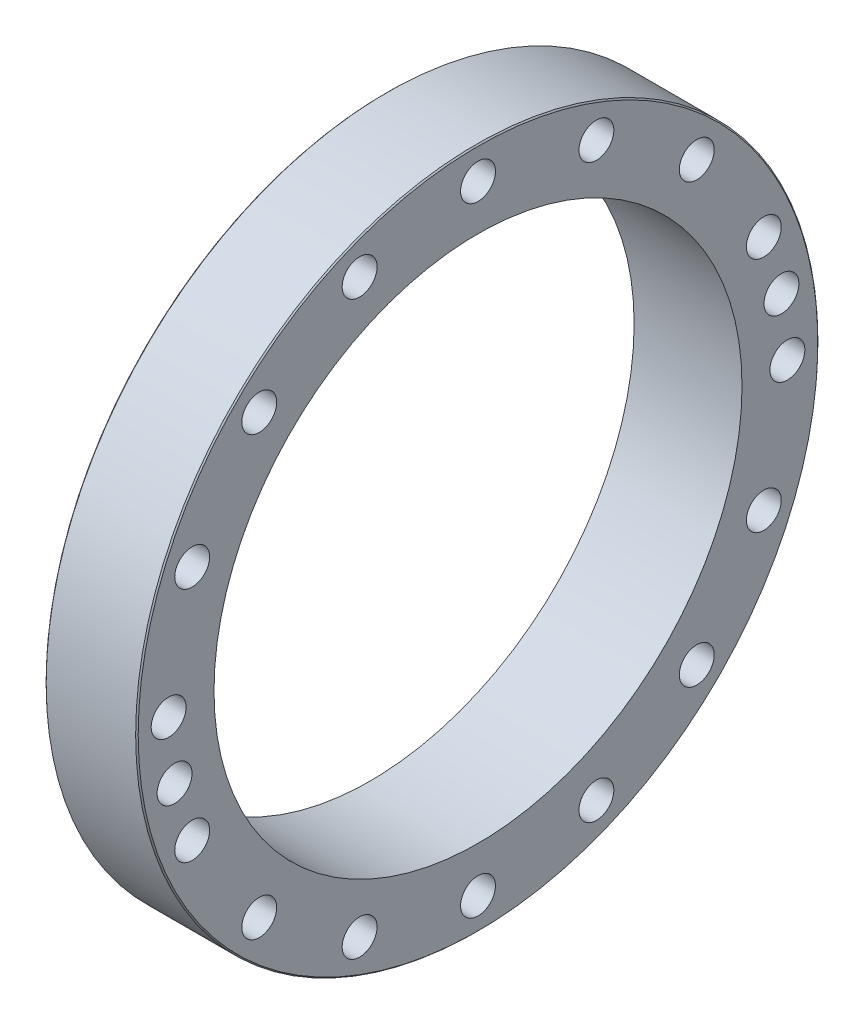
ISO-10303-21;
HEADER;
FILE_DESCRIPTION(('STEP AP214'),'2;1');
FILE_NAME('part.step','',(''),(''),'','','');
FILE_SCHEMA(('AUTOMOTIVE_DESIGN { 1 0 10303 214 1 1 1 1 }'));
ENDSEC;
DATA;
#1=APPLICATION_CONTEXT('core data for automotive mechanical design processes');
#2=APPLICATION_PROTOCOL_DEFINITION('international standard','automotive_design',2000,#1);
#3=PRODUCT_CONTEXT('',#1,'mechanical');
#4=PRODUCT('Part','Part','',(#3));
#5=PRODUCT_RELATED_PRODUCT_CATEGORY('part','',(#4));
#6=PRODUCT_DEFINITION_FORMATION('','',#4);
#7=PRODUCT_DEFINITION_CONTEXT('part definition',#1,'design');
#8=PRODUCT_DEFINITION('design','',#6,#7);
#9=PRODUCT_DEFINITION_SHAPE('','',#8);
#10=(LENGTH_UNIT() NAMED_UNIT(*) SI_UNIT(.MILLI.,.METRE.));
#11=(NAMED_UNIT(*) PLANE_ANGLE_UNIT() SI_UNIT($,.RADIAN.));
#12=(NAMED_UNIT(*) SI_UNIT($,.STERADIAN.) SOLID_ANGLE_UNIT());
#13=UNCERTAINTY_MEASURE_WITH_UNIT(LENGTH_MEASURE(1.E-05),#10,'distance_accuracy_value','');
#14=(GEOMETRIC_REPRESENTATION_CONTEXT(3) GLOBAL_UNCERTAINTY_ASSIGNED_CONTEXT((#13)) GLOBAL_UNIT_ASSIGNED_CONTEXT((#10,
#11,#12)) REPRESENTATION_CONTEXT('',''));
#15=CARTESIAN_POINT('',(0.,0.,0.));
#16=DIRECTION('',(0.,0.,1.));
#17=DIRECTION('',(1.,0.,0.));
#18=AXIS2_PLACEMENT_3D('',#15,#16,#17);
#19=CARTESIAN_POINT('',(60.1,-19.0213063965725,95.6265648393158));
#20=DIRECTION('',(-1.,0.,0.));
#21=DIRECTION('',(0.,0.,1.00000000000001));
#22=AXIS2_PLACEMENT_3D('',#19,#20,#21);
#23=CYLINDRICAL_SURFACE('',#22,4.25);
#24=CARTESIAN_POINT('',(66.8499999999312,-19.0213063965725,95.6265648393158));
#25=DIRECTION('',(1.,0.,0.));
#26=DIRECTION('',(0.,0.195090322018537,-0.980785280402758));
#27=AXIS2_PLACEMENT_3D('',#24,#25,#26);
#28=CIRCLE('',#27,4.24999999995026);
#29=CARTESIAN_POINT('',(66.8499999999312,-18.1921725280034,91.4582273976528));
#30=VERTEX_POINT('',#29);
#31=EDGE_CURVE('E37',#30,#30,#28,.T.);
#32=ORIENTED_EDGE('',*,*,#31,.T.);
#33=EDGE_LOOP('',(#32));
#34=FACE_BOUND('',#33,.T.);
#35=CARTESIAN_POINT('',(53.3500000000231,-19.0213063965725,95.6265648393158));
#36=DIRECTION('',(-1.,0.,0.));
#37=DIRECTION('',(0.,0.195090322016636,-0.980785280403136));
#38=AXIS2_PLACEMENT_3D('',#35,#36,#37);
#39=CIRCLE('',#38,4.25000000006453);
#40=CARTESIAN_POINT('',(53.3500000000231,-18.1921725279892,91.4582273975391));
#41=VERTEX_POINT('',#40);
#42=EDGE_CURVE('E180',#41,#41,#39,.T.);
#43=ORIENTED_EDGE('',*,*,#42,.T.);
#44=EDGE_LOOP('',(#43));
#45=FACE_BOUND('',#44,.T.);
#46=ADVANCED_FACE('F22',(#34,#45),#23,.F.);
#47=CARTESIAN_POINT('',(60.1,19.0213063965725,-95.6265648393158));
#48=DIRECTION('',(-1.,0.,0.));
#49=DIRECTION('',(0.,0.,1.00000000000001));
#50=AXIS2_PLACEMENT_3D('',#47,#48,#49);
#51=CYLINDRICAL_SURFACE('',#50,4.25);
#52=CARTESIAN_POINT('',(66.8499999999312,19.0213063965725,-95.6265648393158));
#53=DIRECTION('',(1.,0.,0.));
#54=DIRECTION('',(0.,-0.195090322018537,0.980785280402758));
#55=AXIS2_PLACEMENT_3D('',#52,#53,#54);
#56=CIRCLE('',#55,4.24999999995026);
#57=CARTESIAN_POINT('',(66.8499999999312,18.1921725280034,-91.4582273976528));
#58=VERTEX_POINT('',#57);
#59=EDGE_CURVE('E186',#58,#58,#56,.T.);
#60=ORIENTED_EDGE('',*,*,#59,.T.);
#61=EDGE_LOOP('',(#60));
#62=FACE_BOUND('',#61,.T.);
#63=CARTESIAN_POINT('',(53.3500000000231,19.0213063965725,-95.6265648393158));
#64=DIRECTION('',(-1.,0.,0.));
#65=DIRECTION('',(0.,-0.195090322016636,0.980785280403136));
#66=AXIS2_PLACEMENT_3D('',#63,#64,#65);
#67=CIRCLE('',#66,4.25000000006453);
#68=CARTESIAN_POINT('',(53.3500000000231,18.1921725279892,-91.4582273975391));
#69=VERTEX_POINT('',#68);
#70=EDGE_CURVE('E175',#69,#69,#67,.T.);
#71=ORIENTED_EDGE('',*,*,#70,.T.);
#72=EDGE_LOOP('',(#71));
#73=FACE_BOUND('',#72,.T.);
#74=ADVANCED_FACE('F198',(#62,#73),#51,.F.);
#75=CARTESIAN_POINT('',(67.5999999999704,-19.0213063965725,95.6265648393158));
#76=DIRECTION('',(1.,0.,0.));
#77=DIRECTION('',(0.,0.,-1.00000000000001));
#78=AXIS2_PLACEMENT_3D('',#75,#76,#77);
#79=CONICAL_SURFACE('',#78,4.99999999995781,0.785398163377527);
#80=CARTESIAN_POINT('',(67.5999999999704,-19.0213063965725,95.6265648393158));
#81=DIRECTION('',(1.,0.,0.));
#82=DIRECTION('',(0.,0.,-1.00000000000001));
#83=AXIS2_PLACEMENT_3D('',#80,#81,#82);
#84=CIRCLE('',#83,4.99999999995781);
#85=CARTESIAN_POINT('',(67.5999999999704,-19.0213063965725,90.6265648393579));
#86=VERTEX_POINT('',#85);
#87=EDGE_CURVE('E25',#86,#86,#84,.T.);
#88=ORIENTED_EDGE('',*,*,#87,.T.);
#89=EDGE_LOOP('',(#88));
#90=FACE_BOUND('',#89,.T.);
#91=ORIENTED_EDGE('',*,*,#31,.F.);
#92=EDGE_LOOP('',(#91));
#93=FACE_BOUND('',#92,.T.);
#94=ADVANCED_FACE('F195',(#90,#93),#79,.F.);
#95=CARTESIAN_POINT('',(67.5999999999704,19.0213063965725,-95.6265648393158));
#96=DIRECTION('',(1.,0.,0.));
#97=DIRECTION('',(0.,0.,-1.00000000000001));
#98=AXIS2_PLACEMENT_3D('',#95,#96,#97);
#99=CONICAL_SURFACE('',#98,4.99999999995781,0.785398163377527);
#100=CARTESIAN_POINT('',(67.5999999999704,19.0213063965725,-95.6265648393158));
#101=DIRECTION('',(1.,0.,0.));
#102=DIRECTION('',(0.,0.,-1.00000000000001));
#103=AXIS2_PLACEMENT_3D('',#100,#101,#102);
#104=CIRCLE('',#103,4.99999999995781);
#105=CARTESIAN_POINT('',(67.5999999999704,19.0213063965725,-100.626564839274));
#106=VERTEX_POINT('',#105);
#107=EDGE_CURVE('E166',#106,#106,#104,.T.);
#108=ORIENTED_EDGE('',*,*,#107,.T.);
#109=EDGE_LOOP('',(#108));
#110=FACE_BOUND('',#109,.T.);
#111=ORIENTED_EDGE('',*,*,#59,.F.);
#112=EDGE_LOOP('',(#111));
#113=FACE_BOUND('',#112,.T.);
#114=ADVANCED_FACE('F197',(#110,#113),#99,.F.);
#115=CARTESIAN_POINT('',(52.5999999999271,-19.0213063965725,95.6265648393158));
#116=DIRECTION('',(-1.,0.,0.));
#117=DIRECTION('',(0.,0.,1.00000000000001));
#118=AXIS2_PLACEMENT_3D('',#115,#116,#117);
#119=CONICAL_SURFACE('',#118,5.00000000013338,0.785398163417663);
#120=ORIENTED_EDGE('',*,*,#42,.F.);
#121=EDGE_LOOP('',(#120));
#122=FACE_BOUND('',#121,.T.);
#123=CARTESIAN_POINT('',(52.5999999999666,-19.0213063965725,95.6265648393158));
#124=DIRECTION('',(-1.,0.,0.));
#125=DIRECTION('',(0.,0.,1.00000000000001));
#126=AXIS2_PLACEMENT_3D('',#123,#124,#125);
#127=CIRCLE('',#126,5.00000000009395);
#128=CARTESIAN_POINT('',(52.5999999999666,-19.0213063965725,100.62656483941));
#129=VERTEX_POINT('',#128);
#130=EDGE_CURVE('E164',#129,#129,#127,.F.);
#131=ORIENTED_EDGE('',*,*,#130,.F.);
#132=EDGE_LOOP('',(#131));
#133=FACE_BOUND('',#132,.T.);
#134=ADVANCED_FACE('F205',(#122,#133),#119,.F.);
#135=CARTESIAN_POINT('',(52.5999999999271,19.0213063965725,-95.6265648393158));
#136=DIRECTION('',(-1.,0.,0.));
#137=DIRECTION('',(0.,0.,1.00000000000001));
#138=AXIS2_PLACEMENT_3D('',#135,#136,#137);
#139=CONICAL_SURFACE('',#138,5.00000000013338,0.785398163417663);
#140=ORIENTED_EDGE('',*,*,#70,.F.);
#141=EDGE_LOOP('',(#140));
#142=FACE_BOUND('',#141,.T.);
#143=CARTESIAN_POINT('',(52.5999999999666,19.0213063965725,-95.6265648393158));
#144=DIRECTION('',(-1.,0.,0.));
#145=DIRECTION('',(0.,0.,1.00000000000001));
#146=AXIS2_PLACEMENT_3D('',#143,#144,#145);
#147=CIRCLE('',#146,5.00000000009395);
#148=CARTESIAN_POINT('',(52.5999999999666,19.0213063965725,-90.6265648392218));
#149=VERTEX_POINT('',#148);
#150=EDGE_CURVE('E161',#149,#149,#147,.F.);
#151=ORIENTED_EDGE('',*,*,#150,.F.);
#152=EDGE_LOOP('',(#151));
#153=FACE_BOUND('',#152,.T.);
#154=ADVANCED_FACE('F324',(#142,#153),#139,.F.);
#155=CARTESIAN_POINT('',(50.5,0.,0.));
#156=DIRECTION('',(-1.,0.,0.));
#157=DIRECTION('',(0.,0.,1.00000000000001));
#158=AXIS2_PLACEMENT_3D('',#155,#156,#157);
#159=CYLINDRICAL_SURFACE('',#158,88.5);
#160=CARTESIAN_POINT('',(52.6,0.,0.));
#161=DIRECTION('',(-1.,0.,0.));
#162=DIRECTION('',(0.,0.,1.00000000000001));
#163=AXIS2_PLACEMENT_3D('',#160,#161,#162);
#164=CIRCLE('',#163,88.5);
#165=CARTESIAN_POINT('',(52.6,0.,88.5000000000006));
#166=VERTEX_POINT('',#165);
#167=EDGE_CURVE('E155',#166,#166,#164,.F.);
#168=ORIENTED_EDGE('',*,*,#167,.F.);
#169=EDGE_LOOP('',(#168));
#170=FACE_BOUND('',#169,.T.);
#171=CARTESIAN_POINT('',(48.4,0.,0.));
#172=DIRECTION('',(1.,0.,0.));
#173=DIRECTION('',(0.,0.,1.00000000000001));
#174=AXIS2_PLACEMENT_3D('',#171,#172,#173);
#175=CIRCLE('',#174,88.5);
#176=CARTESIAN_POINT('',(48.4,0.,88.5000000000006));
#177=VERTEX_POINT('',#176);
#178=EDGE_CURVE('E171',#177,#177,#175,.F.);
#179=ORIENTED_EDGE('',*,*,#178,.F.);
#180=EDGE_LOOP('',(#179));
#181=FACE_BOUND('',#180,.T.);
#182=ADVANCED_FACE('F321',(#170,#181),#159,.T.);
#183=CARTESIAN_POINT('',(48.4,0.,0.));
#184=DIRECTION('',(1.,0.,0.));
#185=DIRECTION('',(0.,0.,-1.00000000000001));
#186=AXIS2_PLACEMENT_3D('',#183,#184,#185);
#187=CONICAL_SURFACE('',#186,88.5,0.785398163397448);
#188=ORIENTED_EDGE('',*,*,#178,.T.);
#189=EDGE_LOOP('',(#188));
#190=FACE_BOUND('',#189,.T.);
#191=CARTESIAN_POINT('',(47.6,0.,0.));
#192=DIRECTION('',(1.,0.,0.));
#193=DIRECTION('',(0.,0.,-1.00000000000001));
#194=AXIS2_PLACEMENT_3D('',#191,#192,#193);
#195=CIRCLE('',#194,87.7);
#196=CARTESIAN_POINT('',(47.6,0.,-87.7000000000005));
#197=VERTEX_POINT('',#196);
#198=EDGE_CURVE('E152',#197,#197,#195,.F.);
#199=ORIENTED_EDGE('',*,*,#198,.F.);
#200=EDGE_LOOP('',(#199));
#201=FACE_BOUND('',#200,.T.);
#202=ADVANCED_FACE('F317',(#190,#201),#187,.T.);
#203=CARTESIAN_POINT('',(53.,0.,0.));
#204=DIRECTION('',(1.,0.,0.));
#205=DIRECTION('',(0.,0.,-1.00000000000001));
#206=AXIS2_PLACEMENT_3D('',#203,#204,#205);
#207=CONICAL_SURFACE('',#206,107.5,0.785398163397448);
#208=CARTESIAN_POINT('',(53.,0.,0.));
#209=DIRECTION('',(-1.,0.,0.));
#210=DIRECTION('',(0.,0.,1.00000000000001));
#211=AXIS2_PLACEMENT_3D('',#208,#209,#210);
#212=CIRCLE('',#211,107.5);
#213=CARTESIAN_POINT('',(53.,0.,107.500000000001));
#214=VERTEX_POINT('',#213);
#215=EDGE_CURVE('E151',#214,#214,#212,.F.);
#216=ORIENTED_EDGE('',*,*,#215,.F.);
#217=EDGE_LOOP('',(#216));
#218=FACE_BOUND('',#217,.T.);
#219=CARTESIAN_POINT('',(52.6,0.,0.));
#220=DIRECTION('',(1.,0.,0.));
#221=DIRECTION('',(0.,0.,-1.00000000000001));
#222=AXIS2_PLACEMENT_3D('',#219,#220,#221);
#223=CIRCLE('',#222,107.1);
#224=CARTESIAN_POINT('',(52.6,0.,-107.100000000001));
#225=VERTEX_POINT('',#224);
#226=EDGE_CURVE('E158',#225,#225,#223,.F.);
#227=ORIENTED_EDGE('',*,*,#226,.F.);
#228=EDGE_LOOP('',(#227));
#229=FACE_BOUND('',#228,.T.);
#230=ADVANCED_FACE('F313',(#218,#229),#207,.T.);
#231=CARTESIAN_POINT('',(67.6,-19.5578047821169,98.3237243604247));
#232=DIRECTION('',(-1.,0.,0.));
#233=DIRECTION('',(0.,0.,1.00000000000001));
#234=AXIS2_PLACEMENT_3D('',#231,#232,#233);
#235=PLANE('',#234);
#236=CARTESIAN_POINT('',(67.6,-19.0213063965725,95.6265648393158));
#237=DIRECTION('',(-1.,0.,0.));
#238=DIRECTION('',(0.,0.,1.00000000000001));
#239=AXIS2_PLACEMENT_3D('',#236,#237,#238);
#240=CIRCLE('',#239,5.5);
#241=CARTESIAN_POINT('',(67.6,-19.0213063965725,101.126564839316));
#242=VERTEX_POINT('',#241);
#243=EDGE_CURVE('E148',#242,#242,#240,.F.);
#244=ORIENTED_EDGE('',*,*,#243,.T.);
#245=EDGE_LOOP('',(#244));
#246=FACE_BOUND('',#245,.T.);
#247=ORIENTED_EDGE('',*,*,#87,.F.);
#248=EDGE_LOOP('',(#247));
#249=FACE_BOUND('',#248,.T.);
#250=ADVANCED_FACE('F309',(#246,#249),#235,.F.);
#251=CARTESIAN_POINT('',(67.6,19.5578047821169,-98.3237243604247));
#252=DIRECTION('',(-1.,0.,0.));
#253=DIRECTION('',(0.,0.,1.00000000000001));
#254=AXIS2_PLACEMENT_3D('',#251,#252,#253);
#255=PLANE('',#254);
#256=CARTESIAN_POINT('',(67.6,19.0213063965725,-95.6265648393158));
#257=DIRECTION('',(-1.,0.,0.));
#258=DIRECTION('',(0.,0.,1.00000000000001));
#259=AXIS2_PLACEMENT_3D('',#256,#257,#258);
#260=CIRCLE('',#259,5.5);
#261=CARTESIAN_POINT('',(67.6,19.0213063965725,-90.1265648393157));
#262=VERTEX_POINT('',#261);
#263=EDGE_CURVE('E145',#262,#262,#260,.F.);
#264=ORIENTED_EDGE('',*,*,#263,.T.);
#265=EDGE_LOOP('',(#264));
#266=FACE_BOUND('',#265,.T.);
#267=ORIENTED_EDGE('',*,*,#107,.F.);
#268=EDGE_LOOP('',(#267));
#269=FACE_BOUND('',#268,.T.);
#270=ADVANCED_FACE('F305',(#266,#269),#255,.F.);
#271=CARTESIAN_POINT('',(52.6,0.,97.8000000000008));
#272=DIRECTION('',(-1.,0.,0.));
#273=DIRECTION('',(0.,0.,1.00000000000001));
#274=AXIS2_PLACEMENT_3D('',#271,#272,#273);
#275=PLANE('',#274);
#276=ORIENTED_EDGE('',*,*,#167,.T.);
#277=EDGE_LOOP('',(#276));
#278=FACE_BOUND('',#277,.T.);
#279=ORIENTED_EDGE('',*,*,#226,.T.);
#280=EDGE_LOOP('',(#279));
#281=FACE_BOUND('',#280,.T.);
#282=CARTESIAN_POINT('',(52.6,0.,-97.5000000000008));
#283=DIRECTION('',(-1.,0.,0.));
#284=DIRECTION('',(0.,0.,1.00000000000001));
#285=AXIS2_PLACEMENT_3D('',#282,#283,#284);
#286=CIRCLE('',#285,5.5);
#287=CARTESIAN_POINT('',(52.6,0.,-92.0000000000008));
#288=VERTEX_POINT('',#287);
#289=EDGE_CURVE('E97',#288,#288,#286,.F.);
#290=ORIENTED_EDGE('',*,*,#289,.T.);
#291=EDGE_LOOP('',(#290));
#292=FACE_BOUND('',#291,.T.);
#293=CARTESIAN_POINT('',(52.6,37.3116346555963,-90.0782544198509));
#294=DIRECTION('',(-1.,0.,0.));
#295=DIRECTION('',(0.,0.,1.00000000000001));
#296=AXIS2_PLACEMENT_3D('',#293,#294,#295);
#297=CIRCLE('',#296,5.5);
#298=CARTESIAN_POINT('',(52.6,37.3116346555963,-84.5782544198509));
#299=VERTEX_POINT('',#298);
#300=EDGE_CURVE('E100',#299,#299,#297,.F.);
#301=ORIENTED_EDGE('',*,*,#300,.T.);
#302=EDGE_LOOP('',(#301));
#303=FACE_BOUND('',#302,.T.);
#304=CARTESIAN_POINT('',(52.6,68.9429111656898,-68.9429111656888));
#305=DIRECTION('',(-1.,0.,0.));
#306=DIRECTION('',(0.,0.,1.00000000000001));
#307=AXIS2_PLACEMENT_3D('',#304,#305,#306);
#308=CIRCLE('',#307,5.5);
#309=CARTESIAN_POINT('',(52.6,68.9429111656898,-63.4429111656888));
#310=VERTEX_POINT('',#309);
#311=EDGE_CURVE('E103',#310,#310,#308,.F.);
#312=ORIENTED_EDGE('',*,*,#311,.T.);
#313=EDGE_LOOP('',(#312));
#314=FACE_BOUND('',#313,.T.);
#315=CARTESIAN_POINT('',(52.6,90.078254419852,-37.3116346555966));
#316=DIRECTION('',(-1.,0.,0.));
#317=DIRECTION('',(0.,0.,1.00000000000001));
#318=AXIS2_PLACEMENT_3D('',#315,#316,#317);
#319=CIRCLE('',#318,5.5);
#320=CARTESIAN_POINT('',(52.6,90.078254419852,-31.8116346555966));
#321=VERTEX_POINT('',#320);
#322=EDGE_CURVE('E106',#321,#321,#319,.F.);
#323=ORIENTED_EDGE('',*,*,#322,.T.);
#324=EDGE_LOOP('',(#323));
#325=FACE_BOUND('',#324,.T.);
#326=CARTESIAN_POINT('',(52.6,97.5000000000015,0.));
#327=DIRECTION('',(-1.,0.,0.));
#328=DIRECTION('',(0.,0.,1.00000000000001));
#329=AXIS2_PLACEMENT_3D('',#326,#327,#328);
#330=CIRCLE('',#329,5.5);
#331=CARTESIAN_POINT('',(52.6,97.5000000000015,5.50000000000003));
#332=VERTEX_POINT('',#331);
#333=EDGE_CURVE('E109',#332,#332,#330,.F.);
#334=ORIENTED_EDGE('',*,*,#333,.T.);
#335=EDGE_LOOP('',(#334));
#336=FACE_BOUND('',#335,.T.);
#337=CARTESIAN_POINT('',(52.6,90.078254419852,37.3116346555964));
#338=DIRECTION('',(-1.,0.,0.));
#339=DIRECTION('',(0.,0.,1.00000000000001));
#340=AXIS2_PLACEMENT_3D('',#337,#338,#339);
#341=CIRCLE('',#340,5.5);
#342=CARTESIAN_POINT('',(52.6,90.078254419852,42.8116346555964));
#343=VERTEX_POINT('',#342);
#344=EDGE_CURVE('E112',#343,#343,#341,.F.);
#345=ORIENTED_EDGE('',*,*,#344,.T.);
#346=EDGE_LOOP('',(#345));
#347=FACE_BOUND('',#346,.T.);
#348=CARTESIAN_POINT('',(52.6,68.9429111656898,68.9429111656888));
#349=DIRECTION('',(-1.,0.,0.));
#350=DIRECTION('',(0.,0.,1.00000000000001));
#351=AXIS2_PLACEMENT_3D('',#348,#349,#350);
#352=CIRCLE('',#351,5.5);
#353=CARTESIAN_POINT('',(52.6,68.9429111656898,74.4429111656888));
#354=VERTEX_POINT('',#353);
#355=EDGE_CURVE('E115',#354,#354,#352,.F.);
#356=ORIENTED_EDGE('',*,*,#355,.T.);
#357=EDGE_LOOP('',(#356));
#358=FACE_BOUND('',#357,.T.);
#359=CARTESIAN_POINT('',(52.6,37.3116346555962,90.0782544198509));
#360=DIRECTION('',(-1.,0.,0.));
#361=DIRECTION('',(0.,0.,1.00000000000001));
#362=AXIS2_PLACEMENT_3D('',#359,#360,#361);
#363=CIRCLE('',#362,5.5);
#364=CARTESIAN_POINT('',(52.6,37.3116346555962,95.5782544198509));
#365=VERTEX_POINT('',#364);
#366=EDGE_CURVE('E118',#365,#365,#363,.F.);
#367=ORIENTED_EDGE('',*,*,#366,.T.);
#368=EDGE_LOOP('',(#367));
#369=FACE_BOUND('',#368,.T.);
#370=CARTESIAN_POINT('',(52.6,0.,97.5000000000008));
#371=DIRECTION('',(-1.,0.,0.));
#372=DIRECTION('',(0.,0.,1.00000000000001));
#373=AXIS2_PLACEMENT_3D('',#370,#371,#372);
#374=CIRCLE('',#373,5.5);
#375=CARTESIAN_POINT('',(52.6,0.,103.000000000001));
#376=VERTEX_POINT('',#375);
#377=EDGE_CURVE('E121',#376,#376,#374,.F.);
#378=ORIENTED_EDGE('',*,*,#377,.T.);
#379=EDGE_LOOP('',(#378));
#380=FACE_BOUND('',#379,.T.);
#381=CARTESIAN_POINT('',(52.6,-37.3116346555962,90.0782544198509));
#382=DIRECTION('',(-1.,0.,0.));
#383=DIRECTION('',(0.,0.,1.00000000000001));
#384=AXIS2_PLACEMENT_3D('',#381,#382,#383);
#385=CIRCLE('',#384,5.5);
#386=CARTESIAN_POINT('',(52.6,-37.3116346555962,95.5782544198509));
#387=VERTEX_POINT('',#386);
#388=EDGE_CURVE('E124',#387,#387,#385,.F.);
#389=ORIENTED_EDGE('',*,*,#388,.T.);
#390=EDGE_LOOP('',(#389));
#391=FACE_BOUND('',#390,.T.);
#392=CARTESIAN_POINT('',(52.6,-68.9429111656884,68.9429111656888));
#393=DIRECTION('',(-1.,0.,0.));
#394=DIRECTION('',(0.,0.,1.00000000000001));
#395=AXIS2_PLACEMENT_3D('',#392,#393,#394);
#396=CIRCLE('',#395,5.5);
#397=CARTESIAN_POINT('',(52.6,-68.9429111656884,74.4429111656888));
#398=VERTEX_POINT('',#397);
#399=EDGE_CURVE('E127',#398,#398,#396,.F.);
#400=ORIENTED_EDGE('',*,*,#399,.T.);
#401=EDGE_LOOP('',(#400));
#402=FACE_BOUND('',#401,.T.);
#403=CARTESIAN_POINT('',(52.6,-90.0782544198505,37.3116346555964));
#404=DIRECTION('',(-1.,0.,0.));
#405=DIRECTION('',(0.,0.,1.00000000000001));
#406=AXIS2_PLACEMENT_3D('',#403,#404,#405);
#407=CIRCLE('',#406,5.5);
#408=CARTESIAN_POINT('',(52.6,-90.0782544198505,42.8116346555964));
#409=VERTEX_POINT('',#408);
#410=EDGE_CURVE('E130',#409,#409,#407,.F.);
#411=ORIENTED_EDGE('',*,*,#410,.T.);
#412=EDGE_LOOP('',(#411));
#413=FACE_BOUND('',#412,.T.);
#414=CARTESIAN_POINT('',(52.6,-97.5,0.));
#415=DIRECTION('',(-1.,0.,0.));
#416=DIRECTION('',(0.,0.,1.00000000000001));
#417=AXIS2_PLACEMENT_3D('',#414,#415,#416);
#418=CIRCLE('',#417,5.5);
#419=CARTESIAN_POINT('',(52.6,-97.5,5.50000000000003));
#420=VERTEX_POINT('',#419);
#421=EDGE_CURVE('E133',#420,#420,#418,.F.);
#422=ORIENTED_EDGE('',*,*,#421,.T.);
#423=EDGE_LOOP('',(#422));
#424=FACE_BOUND('',#423,.T.);
#425=CARTESIAN_POINT('',(52.6,-90.0782544198505,-37.3116346555965));
#426=DIRECTION('',(-1.,0.,0.));
#427=DIRECTION('',(0.,0.,1.00000000000001));
#428=AXIS2_PLACEMENT_3D('',#425,#426,#427);
#429=CIRCLE('',#428,5.5);
#430=CARTESIAN_POINT('',(52.6,-90.0782544198505,-31.8116346555965));
#431=VERTEX_POINT('',#430);
#432=EDGE_CURVE('E136',#431,#431,#429,.F.);
#433=ORIENTED_EDGE('',*,*,#432,.T.);
#434=EDGE_LOOP('',(#433));
#435=FACE_BOUND('',#434,.T.);
#436=CARTESIAN_POINT('',(52.6,-68.9429111656883,-68.9429111656888));
#437=DIRECTION('',(-1.,0.,0.));
#438=DIRECTION('',(0.,0.,1.00000000000001));
#439=AXIS2_PLACEMENT_3D('',#436,#437,#438);
#440=CIRCLE('',#439,5.5);
#441=CARTESIAN_POINT('',(52.6,-68.9429111656883,-63.4429111656888));
#442=VERTEX_POINT('',#441);
#443=EDGE_CURVE('E139',#442,#442,#440,.F.);
#444=ORIENTED_EDGE('',*,*,#443,.T.);
#445=EDGE_LOOP('',(#444));
#446=FACE_BOUND('',#445,.T.);
#447=CARTESIAN_POINT('',(52.6,-37.3116346555962,-90.0782544198509));
#448=DIRECTION('',(-1.,0.,0.));
#449=DIRECTION('',(0.,0.,1.00000000000001));
#450=AXIS2_PLACEMENT_3D('',#447,#448,#449);
#451=CIRCLE('',#450,5.5);
#452=CARTESIAN_POINT('',(52.6,-37.3116346555962,-84.5782544198509));
#453=VERTEX_POINT('',#452);
#454=EDGE_CURVE('E142',#453,#453,#451,.F.);
#455=ORIENTED_EDGE('',*,*,#454,.T.);
#456=EDGE_LOOP('',(#455));
#457=FACE_BOUND('',#456,.T.);
#458=ORIENTED_EDGE('',*,*,#150,.T.);
#459=EDGE_LOOP('',(#458));
#460=FACE_BOUND('',#459,.T.);
#461=ORIENTED_EDGE('',*,*,#130,.T.);
#462=EDGE_LOOP('',(#461));
#463=FACE_BOUND('',#462,.T.);
#464=ADVANCED_FACE('F301',(#278,#281,#292,#303,#314,#325,#336,#347,#358,#369,#380,#391,#402,
#413,#424,#435,#446,#457,#460,#463),#275,.T.);
#465=CARTESIAN_POINT('',(47.6,0.,85.4520000000004));
#466=DIRECTION('',(-1.,0.,0.));
#467=DIRECTION('',(0.,0.,1.00000000000001));
#468=AXIS2_PLACEMENT_3D('',#465,#466,#467);
#469=PLANE('',#468);
#470=CARTESIAN_POINT('',(47.6,0.,0.));
#471=DIRECTION('',(-1.,0.,0.));
#472=DIRECTION('',(0.,0.,1.00000000000001));
#473=AXIS2_PLACEMENT_3D('',#470,#471,#472);
#474=CIRCLE('',#473,83.204);
#475=CARTESIAN_POINT('',(47.6,0.,83.2040000000005));
#476=VERTEX_POINT('',#475);
#477=EDGE_CURVE('E94',#476,#476,#474,.F.);
#478=ORIENTED_EDGE('',*,*,#477,.T.);
#479=EDGE_LOOP('',(#478));
#480=FACE_BOUND('',#479,.T.);
#481=ORIENTED_EDGE('',*,*,#198,.T.);
#482=EDGE_LOOP('',(#481));
#483=FACE_BOUND('',#482,.T.);
#484=ADVANCED_FACE('F297',(#480,#483),#469,.T.);
#485=CARTESIAN_POINT('',(67.1,0.,0.));
#486=DIRECTION('',(-1.,0.,0.));
#487=DIRECTION('',(0.,0.,1.00000000000001));
#488=AXIS2_PLACEMENT_3D('',#485,#486,#487);
#489=CYLINDRICAL_SURFACE('',#488,107.5);
#490=CARTESIAN_POINT('',(81.2,0.,0.));
#491=DIRECTION('',(-1.,0.,0.));
#492=DIRECTION('',(0.,0.,1.00000000000001));
#493=AXIS2_PLACEMENT_3D('',#490,#491,#492);
#494=CIRCLE('',#493,107.5);
#495=CARTESIAN_POINT('',(81.2,0.,107.500000000001));
#496=VERTEX_POINT('',#495);
#497=EDGE_CURVE('E93',#496,#496,#494,.F.);
#498=ORIENTED_EDGE('',*,*,#497,.F.);
#499=EDGE_LOOP('',(#498));
#500=FACE_BOUND('',#499,.T.);
#501=ORIENTED_EDGE('',*,*,#215,.T.);
#502=EDGE_LOOP('',(#501));
#503=FACE_BOUND('',#502,.T.);
#504=ADVANCED_FACE('F293',(#500,#503),#489,.T.);
#505=CARTESIAN_POINT('',(74.6,-19.0213063965725,95.6265648393158));
#506=DIRECTION('',(-1.,0.,0.));
#507=DIRECTION('',(0.,0.,1.00000000000001));
#508=AXIS2_PLACEMENT_3D('',#505,#506,#507);
#509=CYLINDRICAL_SURFACE('',#508,5.5);
#510=CARTESIAN_POINT('',(81.6,-19.0213063965725,95.6265648393158));
#511=DIRECTION('',(-1.,0.,0.));
#512=DIRECTION('',(0.,0.,1.00000000000001));
#513=AXIS2_PLACEMENT_3D('',#510,#511,#512);
#514=CIRCLE('',#513,5.5);
#515=CARTESIAN_POINT('',(81.6,-19.0213063965725,101.126564839316));
#516=VERTEX_POINT('',#515);
#517=EDGE_CURVE('E90',#516,#516,#514,.T.);
#518=ORIENTED_EDGE('',*,*,#517,.F.);
#519=EDGE_LOOP('',(#518));
#520=FACE_BOUND('',#519,.T.);
#521=ORIENTED_EDGE('',*,*,#243,.F.);
#522=EDGE_LOOP('',(#521));
#523=FACE_BOUND('',#522,.T.);
#524=ADVANCED_FACE('F289',(#520,#523),#509,.F.);
#525=CARTESIAN_POINT('',(74.6,19.0213063965725,-95.6265648393158));
#526=DIRECTION('',(-1.,0.,0.));
#527=DIRECTION('',(0.,0.,1.00000000000001));
#528=AXIS2_PLACEMENT_3D('',#525,#526,#527);
#529=CYLINDRICAL_SURFACE('',#528,5.5);
#530=CARTESIAN_POINT('',(81.6,19.0213063965725,-95.6265648393158));
#531=DIRECTION('',(-1.,0.,0.));
#532=DIRECTION('',(0.,0.,1.00000000000001));
#533=AXIS2_PLACEMENT_3D('',#530,#531,#532);
#534=CIRCLE('',#533,5.5);
#535=CARTESIAN_POINT('',(81.6,19.0213063965725,-90.1265648393157));
#536=VERTEX_POINT('',#535);
#537=EDGE_CURVE('E87',#536,#536,#534,.T.);
#538=ORIENTED_EDGE('',*,*,#537,.F.);
#539=EDGE_LOOP('',(#538));
#540=FACE_BOUND('',#539,.T.);
#541=ORIENTED_EDGE('',*,*,#263,.F.);
#542=EDGE_LOOP('',(#541));
#543=FACE_BOUND('',#542,.T.);
#544=ADVANCED_FACE('F285',(#540,#543),#529,.F.);
#545=CARTESIAN_POINT('',(67.1,-37.3116346555962,-90.0782544198509));
#546=DIRECTION('',(-1.,0.,0.));
#547=DIRECTION('',(0.,0.,1.00000000000001));
#548=AXIS2_PLACEMENT_3D('',#545,#546,#547);
#549=CYLINDRICAL_SURFACE('',#548,5.5);
#550=CARTESIAN_POINT('',(81.6,-37.3116346555962,-90.0782544198509));
#551=DIRECTION('',(-1.,0.,0.));
#552=DIRECTION('',(0.,0.,1.00000000000001));
#553=AXIS2_PLACEMENT_3D('',#550,#551,#552);
#554=CIRCLE('',#553,5.5);
#555=CARTESIAN_POINT('',(81.6,-37.3116346555962,-84.5782544198509));
#556=VERTEX_POINT('',#555);
#557=EDGE_CURVE('E84',#556,#556,#554,.T.);
#558=ORIENTED_EDGE('',*,*,#557,.F.);
#559=EDGE_LOOP('',(#558));
#560=FACE_BOUND('',#559,.T.);
#561=ORIENTED_EDGE('',*,*,#454,.F.);
#562=EDGE_LOOP('',(#561));
#563=FACE_BOUND('',#562,.T.);
#564=ADVANCED_FACE('F281',(#560,#563),#549,.F.);
#565=CARTESIAN_POINT('',(67.1,-68.9429111656883,-68.9429111656888));
#566=DIRECTION('',(-1.,0.,0.));
#567=DIRECTION('',(0.,0.,1.00000000000001));
#568=AXIS2_PLACEMENT_3D('',#565,#566,#567);
#569=CYLINDRICAL_SURFACE('',#568,5.5);
#570=CARTESIAN_POINT('',(81.6,-68.9429111656883,-68.9429111656888));
#571=DIRECTION('',(-1.,0.,0.));
#572=DIRECTION('',(0.,0.,1.00000000000001));
#573=AXIS2_PLACEMENT_3D('',#570,#571,#572);
#574=CIRCLE('',#573,5.5);
#575=CARTESIAN_POINT('',(81.6,-68.9429111656883,-63.4429111656888));
#576=VERTEX_POINT('',#575);
#577=EDGE_CURVE('E81',#576,#576,#574,.T.);
#578=ORIENTED_EDGE('',*,*,#577,.F.);
#579=EDGE_LOOP('',(#578));
#580=FACE_BOUND('',#579,.T.);
#581=ORIENTED_EDGE('',*,*,#443,.F.);
#582=EDGE_LOOP('',(#581));
#583=FACE_BOUND('',#582,.T.);
#584=ADVANCED_FACE('F277',(#580,#583),#569,.F.);
#585=CARTESIAN_POINT('',(67.1,-90.0782544198505,-37.3116346555965));
#586=DIRECTION('',(-1.,0.,0.));
#587=DIRECTION('',(0.,0.,1.00000000000001));
#588=AXIS2_PLACEMENT_3D('',#585,#586,#587);
#589=CYLINDRICAL_SURFACE('',#588,5.5);
#590=CARTESIAN_POINT('',(81.6,-90.0782544198505,-37.3116346555965));
#591=DIRECTION('',(-1.,0.,0.));
#592=DIRECTION('',(0.,0.,1.00000000000001));
#593=AXIS2_PLACEMENT_3D('',#590,#591,#592);
#594=CIRCLE('',#593,5.5);
#595=CARTESIAN_POINT('',(81.6,-90.0782544198505,-31.8116346555965));
#596=VERTEX_POINT('',#595);
#597=EDGE_CURVE('E78',#596,#596,#594,.T.);
#598=ORIENTED_EDGE('',*,*,#597,.F.);
#599=EDGE_LOOP('',(#598));
#600=FACE_BOUND('',#599,.T.);
#601=ORIENTED_EDGE('',*,*,#432,.F.);
#602=EDGE_LOOP('',(#601));
#603=FACE_BOUND('',#602,.T.);
#604=ADVANCED_FACE('F273',(#600,#603),#589,.F.);
#605=CARTESIAN_POINT('',(67.1,-97.5,0.));
#606=DIRECTION('',(-1.,0.,0.));
#607=DIRECTION('',(0.,0.,1.00000000000001));
#608=AXIS2_PLACEMENT_3D('',#605,#606,#607);
#609=CYLINDRICAL_SURFACE('',#608,5.5);
#610=CARTESIAN_POINT('',(81.6,-97.5,0.));
#611=DIRECTION('',(-1.,0.,0.));
#612=DIRECTION('',(0.,0.,1.00000000000001));
#613=AXIS2_PLACEMENT_3D('',#610,#611,#612);
#614=CIRCLE('',#613,5.5);
#615=CARTESIAN_POINT('',(81.6,-97.5,5.50000000000003));
#616=VERTEX_POINT('',#615);
#617=EDGE_CURVE('E75',#616,#616,#614,.T.);
#618=ORIENTED_EDGE('',*,*,#617,.F.);
#619=EDGE_LOOP('',(#618));
#620=FACE_BOUND('',#619,.T.);
#621=ORIENTED_EDGE('',*,*,#421,.F.);
#622=EDGE_LOOP('',(#621));
#623=FACE_BOUND('',#622,.T.);
#624=ADVANCED_FACE('F269',(#620,#623),#609,.F.);
#625=CARTESIAN_POINT('',(67.1,-90.0782544198505,37.3116346555964));
#626=DIRECTION('',(-1.,0.,0.));
#627=DIRECTION('',(0.,0.,1.00000000000001));
#628=AXIS2_PLACEMENT_3D('',#625,#626,#627);
#629=CYLINDRICAL_SURFACE('',#628,5.5);
#630=CARTESIAN_POINT('',(81.6,-90.0782544198505,37.3116346555964));
#631=DIRECTION('',(-1.,0.,0.));
#632=DIRECTION('',(0.,0.,1.00000000000001));
#633=AXIS2_PLACEMENT_3D('',#630,#631,#632);
#634=CIRCLE('',#633,5.5);
#635=CARTESIAN_POINT('',(81.6,-90.0782544198505,42.8116346555964));
#636=VERTEX_POINT('',#635);
#637=EDGE_CURVE('E72',#636,#636,#634,.T.);
#638=ORIENTED_EDGE('',*,*,#637,.F.);
#639=EDGE_LOOP('',(#638));
#640=FACE_BOUND('',#639,.T.);
#641=ORIENTED_EDGE('',*,*,#410,.F.);
#642=EDGE_LOOP('',(#641));
#643=FACE_BOUND('',#642,.T.);
#644=ADVANCED_FACE('F265',(#640,#643),#629,.F.);
#645=CARTESIAN_POINT('',(67.1,-68.9429111656884,68.9429111656888));
#646=DIRECTION('',(-1.,0.,0.));
#647=DIRECTION('',(0.,0.,1.00000000000001));
#648=AXIS2_PLACEMENT_3D('',#645,#646,#647);
#649=CYLINDRICAL_SURFACE('',#648,5.5);
#650=CARTESIAN_POINT('',(81.6,-68.9429111656884,68.9429111656888));
#651=DIRECTION('',(-1.,0.,0.));
#652=DIRECTION('',(0.,0.,1.00000000000001));
#653=AXIS2_PLACEMENT_3D('',#650,#651,#652);
#654=CIRCLE('',#653,5.5);
#655=CARTESIAN_POINT('',(81.6,-68.9429111656884,74.4429111656888));
#656=VERTEX_POINT('',#655);
#657=EDGE_CURVE('E69',#656,#656,#654,.T.);
#658=ORIENTED_EDGE('',*,*,#657,.F.);
#659=EDGE_LOOP('',(#658));
#660=FACE_BOUND('',#659,.T.);
#661=ORIENTED_EDGE('',*,*,#399,.F.);
#662=EDGE_LOOP('',(#661));
#663=FACE_BOUND('',#662,.T.);
#664=ADVANCED_FACE('F261',(#660,#663),#649,.F.);
#665=CARTESIAN_POINT('',(67.1,-37.3116346555962,90.0782544198509));
#666=DIRECTION('',(-1.,0.,0.));
#667=DIRECTION('',(0.,0.,1.00000000000001));
#668=AXIS2_PLACEMENT_3D('',#665,#666,#667);
#669=CYLINDRICAL_SURFACE('',#668,5.5);
#670=CARTESIAN_POINT('',(81.6,-37.3116346555962,90.0782544198509));
#671=DIRECTION('',(-1.,0.,0.));
#672=DIRECTION('',(0.,0.,1.00000000000001));
#673=AXIS2_PLACEMENT_3D('',#670,#671,#672);
#674=CIRCLE('',#673,5.5);
#675=CARTESIAN_POINT('',(81.6,-37.3116346555962,95.5782544198509));
#676=VERTEX_POINT('',#675);
#677=EDGE_CURVE('E66',#676,#676,#674,.T.);
#678=ORIENTED_EDGE('',*,*,#677,.F.);
#679=EDGE_LOOP('',(#678));
#680=FACE_BOUND('',#679,.T.);
#681=ORIENTED_EDGE('',*,*,#388,.F.);
#682=EDGE_LOOP('',(#681));
#683=FACE_BOUND('',#682,.T.);
#684=ADVANCED_FACE('F257',(#680,#683),#669,.F.);
#685=CARTESIAN_POINT('',(67.1,0.,97.5000000000008));
#686=DIRECTION('',(-1.,0.,0.));
#687=DIRECTION('',(0.,0.,1.00000000000001));
#688=AXIS2_PLACEMENT_3D('',#685,#686,#687);
#689=CYLINDRICAL_SURFACE('',#688,5.5);
#690=CARTESIAN_POINT('',(81.6,0.,97.5000000000008));
#691=DIRECTION('',(-1.,0.,0.));
#692=DIRECTION('',(0.,0.,1.00000000000001));
#693=AXIS2_PLACEMENT_3D('',#690,#691,#692);
#694=CIRCLE('',#693,5.5);
#695=CARTESIAN_POINT('',(81.6,0.,103.000000000001));
#696=VERTEX_POINT('',#695);
#697=EDGE_CURVE('E63',#696,#696,#694,.T.);
#698=ORIENTED_EDGE('',*,*,#697,.F.);
#699=EDGE_LOOP('',(#698));
#700=FACE_BOUND('',#699,.T.);
#701=ORIENTED_EDGE('',*,*,#377,.F.);
#702=EDGE_LOOP('',(#701));
#703=FACE_BOUND('',#702,.T.);
#704=ADVANCED_FACE('F253',(#700,#703),#689,.F.);
#705=CARTESIAN_POINT('',(67.1,37.3116346555962,90.0782544198509));
#706=DIRECTION('',(-1.,0.,0.));
#707=DIRECTION('',(0.,0.,1.00000000000001));
#708=AXIS2_PLACEMENT_3D('',#705,#706,#707);
#709=CYLINDRICAL_SURFACE('',#708,5.5);
#710=CARTESIAN_POINT('',(81.6,37.3116346555962,90.0782544198509));
#711=DIRECTION('',(-1.,0.,0.));
#712=DIRECTION('',(0.,0.,1.00000000000001));
#713=AXIS2_PLACEMENT_3D('',#710,#711,#712);
#714=CIRCLE('',#713,5.5);
#715=CARTESIAN_POINT('',(81.6,37.3116346555962,95.5782544198509));
#716=VERTEX_POINT('',#715);
#717=EDGE_CURVE('E60',#716,#716,#714,.T.);
#718=ORIENTED_EDGE('',*,*,#717,.F.);
#719=EDGE_LOOP('',(#718));
#720=FACE_BOUND('',#719,.T.);
#721=ORIENTED_EDGE('',*,*,#366,.F.);
#722=EDGE_LOOP('',(#721));
#723=FACE_BOUND('',#722,.T.);
#724=ADVANCED_FACE('F249',(#720,#723),#709,.F.);
#725=CARTESIAN_POINT('',(67.1,68.9429111656898,68.9429111656888));
#726=DIRECTION('',(-1.,0.,0.));
#727=DIRECTION('',(0.,0.,1.00000000000001));
#728=AXIS2_PLACEMENT_3D('',#725,#726,#727);
#729=CYLINDRICAL_SURFACE('',#728,5.5);
#730=CARTESIAN_POINT('',(81.6,68.9429111656898,68.9429111656888));
#731=DIRECTION('',(-1.,0.,0.));
#732=DIRECTION('',(0.,0.,1.00000000000001));
#733=AXIS2_PLACEMENT_3D('',#730,#731,#732);
#734=CIRCLE('',#733,5.5);
#735=CARTESIAN_POINT('',(81.6,68.9429111656898,74.4429111656888));
#736=VERTEX_POINT('',#735);
#737=EDGE_CURVE('E57',#736,#736,#734,.T.);
#738=ORIENTED_EDGE('',*,*,#737,.F.);
#739=EDGE_LOOP('',(#738));
#740=FACE_BOUND('',#739,.T.);
#741=ORIENTED_EDGE('',*,*,#355,.F.);
#742=EDGE_LOOP('',(#741));
#743=FACE_BOUND('',#742,.T.);
#744=ADVANCED_FACE('F245',(#740,#743),#729,.F.);
#745=CARTESIAN_POINT('',(67.1,90.078254419852,37.3116346555964));
#746=DIRECTION('',(-1.,0.,0.));
#747=DIRECTION('',(0.,0.,1.00000000000001));
#748=AXIS2_PLACEMENT_3D('',#745,#746,#747);
#749=CYLINDRICAL_SURFACE('',#748,5.5);
#750=CARTESIAN_POINT('',(81.6,90.078254419852,37.3116346555964));
#751=DIRECTION('',(-1.,0.,0.));
#752=DIRECTION('',(0.,0.,1.00000000000001));
#753=AXIS2_PLACEMENT_3D('',#750,#751,#752);
#754=CIRCLE('',#753,5.5);
#755=CARTESIAN_POINT('',(81.6,90.078254419852,42.8116346555964));
#756=VERTEX_POINT('',#755);
#757=EDGE_CURVE('E54',#756,#756,#754,.T.);
#758=ORIENTED_EDGE('',*,*,#757,.F.);
#759=EDGE_LOOP('',(#758));
#760=FACE_BOUND('',#759,.T.);
#761=ORIENTED_EDGE('',*,*,#344,.F.);
#762=EDGE_LOOP('',(#761));
#763=FACE_BOUND('',#762,.T.);
#764=ADVANCED_FACE('F241',(#760,#763),#749,.F.);
#765=CARTESIAN_POINT('',(67.1,97.5000000000015,0.));
#766=DIRECTION('',(-1.,0.,0.));
#767=DIRECTION('',(0.,0.,1.00000000000001));
#768=AXIS2_PLACEMENT_3D('',#765,#766,#767);
#769=CYLINDRICAL_SURFACE('',#768,5.5);
#770=CARTESIAN_POINT('',(81.6,97.5000000000015,0.));
#771=DIRECTION('',(-1.,0.,0.));
#772=DIRECTION('',(0.,0.,1.00000000000001));
#773=AXIS2_PLACEMENT_3D('',#770,#771,#772);
#774=CIRCLE('',#773,5.5);
#775=CARTESIAN_POINT('',(81.6,97.5000000000015,5.50000000000003));
#776=VERTEX_POINT('',#775);
#777=EDGE_CURVE('E51',#776,#776,#774,.T.);
#778=ORIENTED_EDGE('',*,*,#777,.F.);
#779=EDGE_LOOP('',(#778));
#780=FACE_BOUND('',#779,.T.);
#781=ORIENTED_EDGE('',*,*,#333,.F.);
#782=EDGE_LOOP('',(#781));
#783=FACE_BOUND('',#782,.T.);
#784=ADVANCED_FACE('F237',(#780,#783),#769,.F.);
#785=CARTESIAN_POINT('',(67.1,90.078254419852,-37.3116346555966));
#786=DIRECTION('',(-1.,0.,0.));
#787=DIRECTION('',(0.,0.,1.00000000000001));
#788=AXIS2_PLACEMENT_3D('',#785,#786,#787);
#789=CYLINDRICAL_SURFACE('',#788,5.5);
#790=CARTESIAN_POINT('',(81.6,90.078254419852,-37.3116346555966));
#791=DIRECTION('',(-1.,0.,0.));
#792=DIRECTION('',(0.,0.,1.00000000000001));
#793=AXIS2_PLACEMENT_3D('',#790,#791,#792);
#794=CIRCLE('',#793,5.5);
#795=CARTESIAN_POINT('',(81.6,90.078254419852,-31.8116346555966));
#796=VERTEX_POINT('',#795);
#797=EDGE_CURVE('E48',#796,#796,#794,.T.);
#798=ORIENTED_EDGE('',*,*,#797,.F.);
#799=EDGE_LOOP('',(#798));
#800=FACE_BOUND('',#799,.T.);
#801=ORIENTED_EDGE('',*,*,#322,.F.);
#802=EDGE_LOOP('',(#801));
#803=FACE_BOUND('',#802,.T.);
#804=ADVANCED_FACE('F233',(#800,#803),#789,.F.);
#805=CARTESIAN_POINT('',(67.1,68.9429111656898,-68.9429111656888));
#806=DIRECTION('',(-1.,0.,0.));
#807=DIRECTION('',(0.,0.,1.00000000000001));
#808=AXIS2_PLACEMENT_3D('',#805,#806,#807);
#809=CYLINDRICAL_SURFACE('',#808,5.5);
#810=CARTESIAN_POINT('',(81.6,68.9429111656898,-68.9429111656888));
#811=DIRECTION('',(-1.,0.,0.));
#812=DIRECTION('',(0.,0.,1.00000000000001));
#813=AXIS2_PLACEMENT_3D('',#810,#811,#812);
#814=CIRCLE('',#813,5.5);
#815=CARTESIAN_POINT('',(81.6,68.9429111656898,-63.4429111656888));
#816=VERTEX_POINT('',#815);
#817=EDGE_CURVE('E45',#816,#816,#814,.T.);
#818=ORIENTED_EDGE('',*,*,#817,.F.);
#819=EDGE_LOOP('',(#818));
#820=FACE_BOUND('',#819,.T.);
#821=ORIENTED_EDGE('',*,*,#311,.F.);
#822=EDGE_LOOP('',(#821));
#823=FACE_BOUND('',#822,.T.);
#824=ADVANCED_FACE('F229',(#820,#823),#809,.F.);
#825=CARTESIAN_POINT('',(67.1,37.3116346555963,-90.0782544198509));
#826=DIRECTION('',(-1.,0.,0.));
#827=DIRECTION('',(0.,0.,1.00000000000001));
#828=AXIS2_PLACEMENT_3D('',#825,#826,#827);
#829=CYLINDRICAL_SURFACE('',#828,5.5);
#830=CARTESIAN_POINT('',(81.6,37.3116346555963,-90.0782544198509));
#831=DIRECTION('',(-1.,0.,0.));
#832=DIRECTION('',(0.,0.,1.00000000000001));
#833=AXIS2_PLACEMENT_3D('',#830,#831,#832);
#834=CIRCLE('',#833,5.5);
#835=CARTESIAN_POINT('',(81.6,37.3116346555963,-84.5782544198509));
#836=VERTEX_POINT('',#835);
#837=EDGE_CURVE('E42',#836,#836,#834,.T.);
#838=ORIENTED_EDGE('',*,*,#837,.F.);
#839=EDGE_LOOP('',(#838));
#840=FACE_BOUND('',#839,.T.);
#841=ORIENTED_EDGE('',*,*,#300,.F.);
#842=EDGE_LOOP('',(#841));
#843=FACE_BOUND('',#842,.T.);
#844=ADVANCED_FACE('F225',(#840,#843),#829,.F.);
#845=CARTESIAN_POINT('',(67.1,0.,-97.5000000000008));
#846=DIRECTION('',(-1.,0.,0.));
#847=DIRECTION('',(0.,0.,1.00000000000001));
#848=AXIS2_PLACEMENT_3D('',#845,#846,#847);
#849=CYLINDRICAL_SURFACE('',#848,5.5);
#850=CARTESIAN_POINT('',(81.6,0.,-97.5000000000008));
#851=DIRECTION('',(-1.,0.,0.));
#852=DIRECTION('',(0.,0.,1.00000000000001));
#853=AXIS2_PLACEMENT_3D('',#850,#851,#852);
#854=CIRCLE('',#853,5.5);
#855=CARTESIAN_POINT('',(81.6,0.,-92.0000000000008));
#856=VERTEX_POINT('',#855);
#857=EDGE_CURVE('E34',#856,#856,#854,.T.);
#858=ORIENTED_EDGE('',*,*,#857,.F.);
#859=EDGE_LOOP('',(#858));
#860=FACE_BOUND('',#859,.T.);
#861=ORIENTED_EDGE('',*,*,#289,.F.);
#862=EDGE_LOOP('',(#861));
#863=FACE_BOUND('',#862,.T.);
#864=ADVANCED_FACE('F221',(#860,#863),#849,.F.);
#865=CARTESIAN_POINT('',(64.6,0.,0.));
#866=DIRECTION('',(-1.,0.,0.));
#867=DIRECTION('',(0.,0.,1.00000000000001));
#868=AXIS2_PLACEMENT_3D('',#865,#866,#867);
#869=CYLINDRICAL_SURFACE('',#868,83.204);
#870=ORIENTED_EDGE('',*,*,#477,.F.);
#871=EDGE_LOOP('',(#870));
#872=FACE_BOUND('',#871,.T.);
#873=CARTESIAN_POINT('',(81.6,0.,0.));
#874=DIRECTION('',(-1.,0.,0.));
#875=DIRECTION('',(0.,0.,1.00000000000001));
#876=AXIS2_PLACEMENT_3D('',#873,#874,#875);
#877=CIRCLE('',#876,83.204);
#878=CARTESIAN_POINT('',(81.6,0.,83.2040000000005));
#879=VERTEX_POINT('',#878);
#880=EDGE_CURVE('E29',#879,#879,#877,.T.);
#881=ORIENTED_EDGE('',*,*,#880,.F.);
#882=EDGE_LOOP('',(#881));
#883=FACE_BOUND('',#882,.T.);
#884=ADVANCED_FACE('F214',(#872,#883),#869,.F.);
#885=CARTESIAN_POINT('',(81.2,0.,0.));
#886=DIRECTION('',(-1.,0.,0.));
#887=DIRECTION('',(0.,0.,1.00000000000001));
#888=AXIS2_PLACEMENT_3D('',#885,#886,#887);
#889=CONICAL_SURFACE('',#888,107.5,0.785398163397448);
#890=CARTESIAN_POINT('',(81.6,0.,0.));
#891=DIRECTION('',(-1.,0.,0.));
#892=DIRECTION('',(0.,0.,1.00000000000001));
#893=AXIS2_PLACEMENT_3D('',#890,#891,#892);
#894=CIRCLE('',#893,107.1);
#895=CARTESIAN_POINT('',(81.6,0.,107.100000000001));
#896=VERTEX_POINT('',#895);
#897=EDGE_CURVE('E12',#896,#896,#894,.F.);
#898=ORIENTED_EDGE('',*,*,#897,.F.);
#899=EDGE_LOOP('',(#898));
#900=FACE_BOUND('',#899,.T.);
#901=ORIENTED_EDGE('',*,*,#497,.T.);
#902=EDGE_LOOP('',(#901));
#903=FACE_BOUND('',#902,.T.);
#904=ADVANCED_FACE('F209',(#900,#903),#889,.T.);
#905=CARTESIAN_POINT('',(81.6,0.,95.1520000000008));
#906=DIRECTION('',(1.,0.,0.));
#907=DIRECTION('',(0.,0.,-1.00000000000001));
#908=AXIS2_PLACEMENT_3D('',#905,#906,#907);
#909=PLANE('',#908);
#910=ORIENTED_EDGE('',*,*,#897,.T.);
#911=EDGE_LOOP('',(#910));
#912=FACE_BOUND('',#911,.T.);
#913=ORIENTED_EDGE('',*,*,#880,.T.);
#914=EDGE_LOOP('',(#913));
#915=FACE_BOUND('',#914,.T.);
#916=ORIENTED_EDGE('',*,*,#857,.T.);
#917=EDGE_LOOP('',(#916));
#918=FACE_BOUND('',#917,.T.);
#919=ORIENTED_EDGE('',*,*,#837,.T.);
#920=EDGE_LOOP('',(#919));
#921=FACE_BOUND('',#920,.T.);
#922=ORIENTED_EDGE('',*,*,#817,.T.);
#923=EDGE_LOOP('',(#922));
#924=FACE_BOUND('',#923,.T.);
#925=ORIENTED_EDGE('',*,*,#797,.T.);
#926=EDGE_LOOP('',(#925));
#927=FACE_BOUND('',#926,.T.);
#928=ORIENTED_EDGE('',*,*,#777,.T.);
#929=EDGE_LOOP('',(#928));
#930=FACE_BOUND('',#929,.T.);
#931=ORIENTED_EDGE('',*,*,#757,.T.);
#932=EDGE_LOOP('',(#931));
#933=FACE_BOUND('',#932,.T.);
#934=ORIENTED_EDGE('',*,*,#737,.T.);
#935=EDGE_LOOP('',(#934));
#936=FACE_BOUND('',#935,.T.);
#937=ORIENTED_EDGE('',*,*,#717,.T.);
#938=EDGE_LOOP('',(#937));
#939=FACE_BOUND('',#938,.T.);
#940=ORIENTED_EDGE('',*,*,#697,.T.);
#941=EDGE_LOOP('',(#940));
#942=FACE_BOUND('',#941,.T.);
#943=ORIENTED_EDGE('',*,*,#677,.T.);
#944=EDGE_LOOP('',(#943));
#945=FACE_BOUND('',#944,.T.);
#946=ORIENTED_EDGE('',*,*,#657,.T.);
#947=EDGE_LOOP('',(#946));
#948=FACE_BOUND('',#947,.T.);
#949=ORIENTED_EDGE('',*,*,#637,.T.);
#950=EDGE_LOOP('',(#949));
#951=FACE_BOUND('',#950,.T.);
#952=ORIENTED_EDGE('',*,*,#617,.T.);
#953=EDGE_LOOP('',(#952));
#954=FACE_BOUND('',#953,.T.);
#955=ORIENTED_EDGE('',*,*,#597,.T.);
#956=EDGE_LOOP('',(#955));
#957=FACE_BOUND('',#956,.T.);
#958=ORIENTED_EDGE('',*,*,#577,.T.);
#959=EDGE_LOOP('',(#958));
#960=FACE_BOUND('',#959,.T.);
#961=ORIENTED_EDGE('',*,*,#557,.T.);
#962=EDGE_LOOP('',(#961));
#963=FACE_BOUND('',#962,.T.);
#964=ORIENTED_EDGE('',*,*,#537,.T.);
#965=EDGE_LOOP('',(#964));
#966=FACE_BOUND('',#965,.T.);
#967=ORIENTED_EDGE('',*,*,#517,.T.);
#968=EDGE_LOOP('',(#967));
#969=FACE_BOUND('',#968,.T.);
#970=ADVANCED_FACE('F207',(#912,#915,#918,#921,#924,#927,#930,#933,#936,#939,#942,#945,#948,
#951,#954,#957,#960,#963,#966,#969),#909,.T.);
#971=CLOSED_SHELL('',(#46,#74,#94,#114,#134,#154,#182,#202,#230,#250,#270,#464,#484,#504,#524,
#544,#564,#584,#604,#624,#644,#664,#684,#704,#724,#744,#764,#784,#804,#824,#844,#864,#884,#904,#970));
#972=MANIFOLD_SOLID_BREP('B1',#971);
#973=ADVANCED_BREP_SHAPE_REPRESENTATION('',(#18,#972),#14);
#974=SHAPE_DEFINITION_REPRESENTATION(#9,#973);
ENDSEC;
END-ISO-10303-21;
